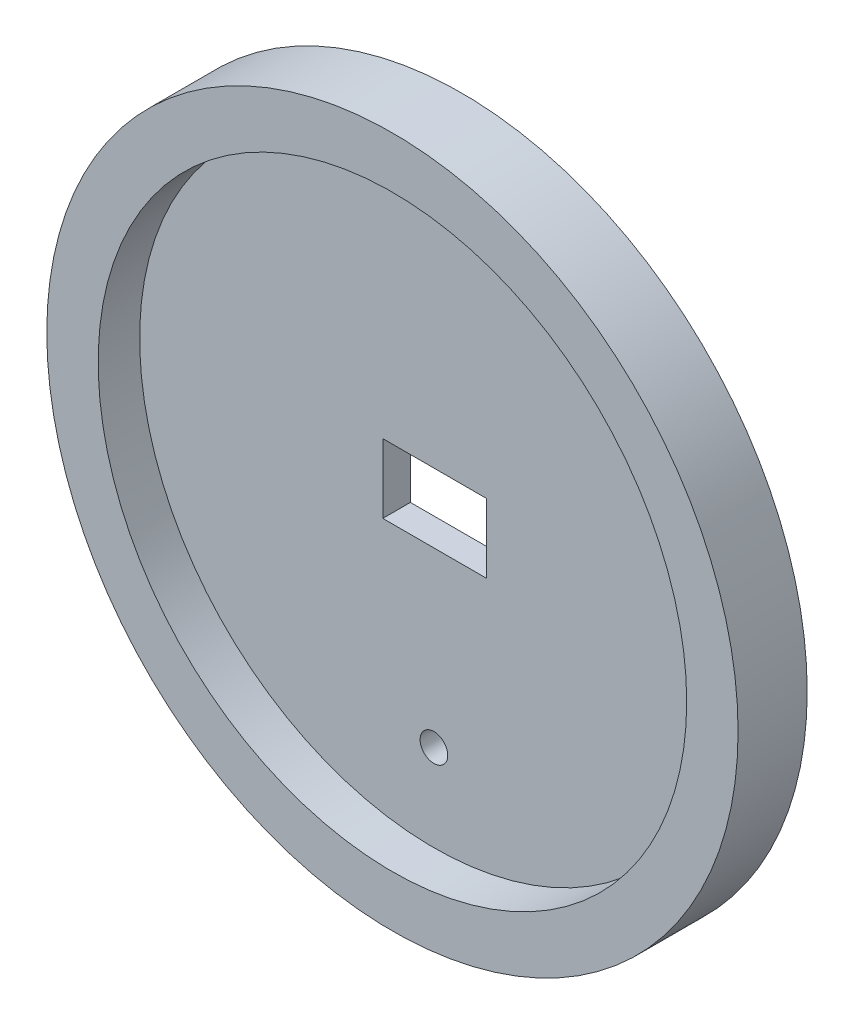
ISO-10303-21;
HEADER;
FILE_DESCRIPTION(('STEP AP214'),'2;1');
FILE_NAME('part.step','',(''),(''),'','','');
FILE_SCHEMA(('AUTOMOTIVE_DESIGN { 1 0 10303 214 1 1 1 1 }'));
ENDSEC;
DATA;
#1=APPLICATION_CONTEXT('core data for automotive mechanical design processes');
#2=APPLICATION_PROTOCOL_DEFINITION('international standard','automotive_design',2000,#1);
#3=PRODUCT_CONTEXT('',#1,'mechanical');
#4=PRODUCT('Part','Part','',(#3));
#5=PRODUCT_RELATED_PRODUCT_CATEGORY('part','',(#4));
#6=PRODUCT_DEFINITION_FORMATION('','',#4);
#7=PRODUCT_DEFINITION_CONTEXT('part definition',#1,'design');
#8=PRODUCT_DEFINITION('design','',#6,#7);
#9=PRODUCT_DEFINITION_SHAPE('','',#8);
#10=(LENGTH_UNIT() NAMED_UNIT(*) SI_UNIT(.MILLI.,.METRE.));
#11=(NAMED_UNIT(*) PLANE_ANGLE_UNIT() SI_UNIT($,.RADIAN.));
#12=(NAMED_UNIT(*) SI_UNIT($,.STERADIAN.) SOLID_ANGLE_UNIT());
#13=UNCERTAINTY_MEASURE_WITH_UNIT(LENGTH_MEASURE(1.E-05),#10,'distance_accuracy_value','');
#14=(GEOMETRIC_REPRESENTATION_CONTEXT(3) GLOBAL_UNCERTAINTY_ASSIGNED_CONTEXT((#13)) GLOBAL_UNIT_ASSIGNED_CONTEXT((#10,
#11,#12)) REPRESENTATION_CONTEXT('',''));
#15=CARTESIAN_POINT('',(0.,0.,0.));
#16=DIRECTION('',(0.,0.,1.));
#17=DIRECTION('',(1.,0.,0.));
#18=AXIS2_PLACEMENT_3D('',#15,#16,#17);
#19=CARTESIAN_POINT('',(-3.7,2.5,5.));
#20=DIRECTION('',(1.,0.,0.));
#21=DIRECTION('',(0.,0.,-1.));
#22=AXIS2_PLACEMENT_3D('',#19,#20,#21);
#23=PLANE('',#22);
#24=DIRECTION('',(0.,0.,-1.));
#25=VECTOR('',#24,1.);
#26=CARTESIAN_POINT('',(-3.7,2.5,5.));
#27=LINE('',#26,#25);
#28=CARTESIAN_POINT('',(-3.7,2.5,2.));
#29=VERTEX_POINT('',#28);
#30=CARTESIAN_POINT('',(-3.7,2.5,0.));
#31=VERTEX_POINT('',#30);
#32=EDGE_CURVE('E57',#29,#31,#27,.T.);
#33=ORIENTED_EDGE('',*,*,#32,.F.);
#34=DIRECTION('',(0.,-1.,0.));
#35=VECTOR('',#34,1.);
#36=CARTESIAN_POINT('',(-3.7,2.5,2.));
#37=LINE('',#36,#35);
#38=CARTESIAN_POINT('',(-3.7,-2.5,2.));
#39=VERTEX_POINT('',#38);
#40=EDGE_CURVE('E50',#29,#39,#37,.T.);
#41=ORIENTED_EDGE('',*,*,#40,.T.);
#42=DIRECTION('',(0.,0.,-1.));
#43=VECTOR('',#42,1.);
#44=CARTESIAN_POINT('',(-3.7,-2.5,5.));
#45=LINE('',#44,#43);
#46=CARTESIAN_POINT('',(-3.7,-2.5,0.));
#47=VERTEX_POINT('',#46);
#48=EDGE_CURVE('E95',#39,#47,#45,.T.);
#49=ORIENTED_EDGE('',*,*,#48,.T.);
#50=DIRECTION('',(0.,-1.,0.));
#51=VECTOR('',#50,1.);
#52=CARTESIAN_POINT('',(-3.7,2.5,0.));
#53=LINE('',#52,#51);
#54=EDGE_CURVE('E113',#31,#47,#53,.T.);
#55=ORIENTED_EDGE('',*,*,#54,.F.);
#56=EDGE_LOOP('',(#33,#41,#49,#55));
#57=FACE_BOUND('',#56,.T.);
#58=ADVANCED_FACE('F33',(#57),#23,.T.);
#59=CARTESIAN_POINT('',(-3.7,-2.5,5.));
#60=DIRECTION('',(0.,1.,0.));
#61=DIRECTION('',(0.,0.,1.));
#62=AXIS2_PLACEMENT_3D('',#59,#60,#61);
#63=PLANE('',#62);
#64=ORIENTED_EDGE('',*,*,#48,.F.);
#65=DIRECTION('',(1.,0.,0.));
#66=VECTOR('',#65,1.);
#67=CARTESIAN_POINT('',(-3.7,-2.5,2.));
#68=LINE('',#67,#66);
#69=CARTESIAN_POINT('',(3.8,-2.5,2.));
#70=VERTEX_POINT('',#69);
#71=EDGE_CURVE('E88',#39,#70,#68,.T.);
#72=ORIENTED_EDGE('',*,*,#71,.T.);
#73=DIRECTION('',(0.,0.,-1.));
#74=VECTOR('',#73,1.);
#75=CARTESIAN_POINT('',(3.8,-2.5,5.));
#76=LINE('',#75,#74);
#77=CARTESIAN_POINT('',(3.8,-2.5,0.));
#78=VERTEX_POINT('',#77);
#79=EDGE_CURVE('E87',#70,#78,#76,.T.);
#80=ORIENTED_EDGE('',*,*,#79,.T.);
#81=DIRECTION('',(1.,0.,0.));
#82=VECTOR('',#81,1.);
#83=CARTESIAN_POINT('',(-3.7,-2.5,0.));
#84=LINE('',#83,#82);
#85=EDGE_CURVE('E116',#47,#78,#84,.T.);
#86=ORIENTED_EDGE('',*,*,#85,.F.);
#87=EDGE_LOOP('',(#64,#72,#80,#86));
#88=FACE_BOUND('',#87,.T.);
#89=ADVANCED_FACE('F127',(#88),#63,.T.);
#90=CARTESIAN_POINT('',(3.8,2.5,5.));
#91=DIRECTION('',(-1.,0.,0.));
#92=DIRECTION('',(0.,-1.,0.));
#93=AXIS2_PLACEMENT_3D('',#90,#91,#92);
#94=PLANE('',#93);
#95=ORIENTED_EDGE('',*,*,#79,.F.);
#96=DIRECTION('',(0.,1.,0.));
#97=VECTOR('',#96,1.);
#98=CARTESIAN_POINT('',(3.8,2.5,2.));
#99=LINE('',#98,#97);
#100=CARTESIAN_POINT('',(3.8,2.5,2.));
#101=VERTEX_POINT('',#100);
#102=EDGE_CURVE('E78',#70,#101,#99,.T.);
#103=ORIENTED_EDGE('',*,*,#102,.T.);
#104=DIRECTION('',(0.,0.,-1.));
#105=VECTOR('',#104,1.);
#106=CARTESIAN_POINT('',(3.8,2.5,5.));
#107=LINE('',#106,#105);
#108=CARTESIAN_POINT('',(3.8,2.5,0.));
#109=VERTEX_POINT('',#108);
#110=EDGE_CURVE('E86',#101,#109,#107,.T.);
#111=ORIENTED_EDGE('',*,*,#110,.T.);
#112=DIRECTION('',(0.,1.,0.));
#113=VECTOR('',#112,1.);
#114=CARTESIAN_POINT('',(3.8,2.5,0.));
#115=LINE('',#114,#113);
#116=EDGE_CURVE('E123',#78,#109,#115,.T.);
#117=ORIENTED_EDGE('',*,*,#116,.F.);
#118=EDGE_LOOP('',(#95,#103,#111,#117));
#119=FACE_BOUND('',#118,.T.);
#120=ADVANCED_FACE('F84',(#119),#94,.T.);
#121=CARTESIAN_POINT('',(-3.7,2.5,5.));
#122=DIRECTION('',(0.,-1.,0.));
#123=DIRECTION('',(0.,0.,-1.));
#124=AXIS2_PLACEMENT_3D('',#121,#122,#123);
#125=PLANE('',#124);
#126=ORIENTED_EDGE('',*,*,#110,.F.);
#127=DIRECTION('',(-1.,0.,0.));
#128=VECTOR('',#127,1.);
#129=CARTESIAN_POINT('',(-3.7,2.5,2.));
#130=LINE('',#129,#128);
#131=EDGE_CURVE('E74',#101,#29,#130,.T.);
#132=ORIENTED_EDGE('',*,*,#131,.T.);
#133=ORIENTED_EDGE('',*,*,#32,.T.);
#134=DIRECTION('',(-1.,0.,0.));
#135=VECTOR('',#134,1.);
#136=CARTESIAN_POINT('',(-3.7,2.5,0.));
#137=LINE('',#136,#135);
#138=EDGE_CURVE('E92',#109,#31,#137,.T.);
#139=ORIENTED_EDGE('',*,*,#138,.F.);
#140=EDGE_LOOP('',(#126,#132,#133,#139));
#141=FACE_BOUND('',#140,.T.);
#142=ADVANCED_FACE('F90',(#141),#125,.T.);
#143=CARTESIAN_POINT('',(0.,-15.,5.));
#144=DIRECTION('',(0.,0.,-1.));
#145=DIRECTION('',(-1.,0.,0.));
#146=AXIS2_PLACEMENT_3D('',#143,#144,#145);
#147=CYLINDRICAL_SURFACE('',#146,1.);
#148=CARTESIAN_POINT('',(0.,-15.,0.));
#149=DIRECTION('',(0.,0.,1.));
#150=DIRECTION('',(1.,0.,0.));
#151=AXIS2_PLACEMENT_3D('',#148,#149,#150);
#152=CIRCLE('',#151,1.);
#153=CARTESIAN_POINT('',(1.,-15.,0.));
#154=VERTEX_POINT('',#153);
#155=EDGE_CURVE('E111',#154,#154,#152,.T.);
#156=ORIENTED_EDGE('',*,*,#155,.F.);
#157=EDGE_LOOP('',(#156));
#158=FACE_BOUND('',#157,.T.);
#159=CARTESIAN_POINT('',(0.,-15.,2.));
#160=DIRECTION('',(0.,0.,1.));
#161=DIRECTION('',(1.,0.,0.));
#162=AXIS2_PLACEMENT_3D('',#159,#160,#161);
#163=CIRCLE('',#162,1.);
#164=CARTESIAN_POINT('',(1.,-15.,2.));
#165=VERTEX_POINT('',#164);
#166=EDGE_CURVE('E37',#165,#165,#163,.T.);
#167=ORIENTED_EDGE('',*,*,#166,.T.);
#168=EDGE_LOOP('',(#167));
#169=FACE_BOUND('',#168,.T.);
#170=ADVANCED_FACE('F139',(#158,#169),#147,.F.);
#171=CARTESIAN_POINT('',(0.,0.,5.));
#172=DIRECTION('',(0.,0.,1.));
#173=DIRECTION('',(1.,0.,0.));
#174=AXIS2_PLACEMENT_3D('',#171,#172,#173);
#175=PLANE('',#174);
#176=CARTESIAN_POINT('',(0.,0.,5.));
#177=DIRECTION('',(0.,0.,1.));
#178=DIRECTION('',(1.,0.,0.));
#179=AXIS2_PLACEMENT_3D('',#176,#177,#178);
#180=CIRCLE('',#179,21.2841121427997);
#181=CARTESIAN_POINT('',(21.2841121427997,0.,5.));
#182=VERTEX_POINT('',#181);
#183=EDGE_CURVE('E129',#182,#182,#180,.T.);
#184=ORIENTED_EDGE('',*,*,#183,.F.);
#185=EDGE_LOOP('',(#184));
#186=FACE_BOUND('',#185,.T.);
#187=CARTESIAN_POINT('',(0.,0.,5.));
#188=DIRECTION('',(0.,0.,1.));
#189=DIRECTION('',(1.,0.,0.));
#190=AXIS2_PLACEMENT_3D('',#187,#188,#189);
#191=CIRCLE('',#190,25.);
#192=CARTESIAN_POINT('',(25.,0.,5.));
#193=VERTEX_POINT('',#192);
#194=EDGE_CURVE('E11',#193,#193,#191,.T.);
#195=ORIENTED_EDGE('',*,*,#194,.T.);
#196=EDGE_LOOP('',(#195));
#197=FACE_BOUND('',#196,.T.);
#198=ADVANCED_FACE('F107',(#186,#197),#175,.T.);
#199=CARTESIAN_POINT('',(0.,0.,0.));
#200=DIRECTION('',(0.,0.,1.));
#201=DIRECTION('',(1.,0.,0.));
#202=AXIS2_PLACEMENT_3D('',#199,#200,#201);
#203=PLANE('',#202);
#204=ORIENTED_EDGE('',*,*,#54,.T.);
#205=ORIENTED_EDGE('',*,*,#85,.T.);
#206=ORIENTED_EDGE('',*,*,#116,.T.);
#207=ORIENTED_EDGE('',*,*,#138,.T.);
#208=EDGE_LOOP('',(#204,#205,#206,#207));
#209=FACE_BOUND('',#208,.T.);
#210=CARTESIAN_POINT('',(0.,0.,0.));
#211=DIRECTION('',(0.,0.,1.));
#212=DIRECTION('',(1.,0.,0.));
#213=AXIS2_PLACEMENT_3D('',#210,#211,#212);
#214=CIRCLE('',#213,25.);
#215=CARTESIAN_POINT('',(25.,0.,0.));
#216=VERTEX_POINT('',#215);
#217=EDGE_CURVE('E42',#216,#216,#214,.T.);
#218=ORIENTED_EDGE('',*,*,#217,.F.);
#219=EDGE_LOOP('',(#218));
#220=FACE_BOUND('',#219,.T.);
#221=ORIENTED_EDGE('',*,*,#155,.T.);
#222=EDGE_LOOP('',(#221));
#223=FACE_BOUND('',#222,.T.);
#224=ADVANCED_FACE('F104',(#209,#220,#223),#203,.F.);
#225=CARTESIAN_POINT('',(0.,0.,5.));
#226=DIRECTION('',(0.,0.,-1.));
#227=DIRECTION('',(-1.,0.,0.));
#228=AXIS2_PLACEMENT_3D('',#225,#226,#227);
#229=CYLINDRICAL_SURFACE('',#228,25.);
#230=ORIENTED_EDGE('',*,*,#194,.F.);
#231=EDGE_LOOP('',(#230));
#232=FACE_BOUND('',#231,.T.);
#233=ORIENTED_EDGE('',*,*,#217,.T.);
#234=EDGE_LOOP('',(#233));
#235=FACE_BOUND('',#234,.T.);
#236=ADVANCED_FACE('F35',(#232,#235),#229,.T.);
#237=CARTESIAN_POINT('',(0.,0.,2.));
#238=DIRECTION('',(0.,0.,1.));
#239=DIRECTION('',(1.,0.,0.));
#240=AXIS2_PLACEMENT_3D('',#237,#238,#239);
#241=CYLINDRICAL_SURFACE('',#240,21.2841121427997);
#242=CARTESIAN_POINT('',(0.,0.,2.));
#243=DIRECTION('',(0.,0.,1.));
#244=DIRECTION('',(1.,0.,0.));
#245=AXIS2_PLACEMENT_3D('',#242,#243,#244);
#246=CIRCLE('',#245,21.2841121427997);
#247=CARTESIAN_POINT('',(21.2841121427997,0.,2.));
#248=VERTEX_POINT('',#247);
#249=EDGE_CURVE('E132',#248,#248,#246,.T.);
#250=ORIENTED_EDGE('',*,*,#249,.F.);
#251=EDGE_LOOP('',(#250));
#252=FACE_BOUND('',#251,.T.);
#253=ORIENTED_EDGE('',*,*,#183,.T.);
#254=EDGE_LOOP('',(#253));
#255=FACE_BOUND('',#254,.T.);
#256=ADVANCED_FACE('F141',(#252,#255),#241,.F.);
#257=CARTESIAN_POINT('',(0.,0.,2.));
#258=DIRECTION('',(0.,0.,1.));
#259=DIRECTION('',(1.,0.,0.));
#260=AXIS2_PLACEMENT_3D('',#257,#258,#259);
#261=PLANE('',#260);
#262=ORIENTED_EDGE('',*,*,#131,.F.);
#263=ORIENTED_EDGE('',*,*,#102,.F.);
#264=ORIENTED_EDGE('',*,*,#71,.F.);
#265=ORIENTED_EDGE('',*,*,#40,.F.);
#266=EDGE_LOOP('',(#262,#263,#264,#265));
#267=FACE_BOUND('',#266,.T.);
#268=ORIENTED_EDGE('',*,*,#166,.F.);
#269=EDGE_LOOP('',(#268));
#270=FACE_BOUND('',#269,.T.);
#271=ORIENTED_EDGE('',*,*,#249,.T.);
#272=EDGE_LOOP('',(#271));
#273=FACE_BOUND('',#272,.T.);
#274=ADVANCED_FACE('F76',(#267,#270,#273),#261,.T.);
#275=CLOSED_SHELL('',(#58,#89,#120,#142,#170,#198,#224,#236,#256,#274));
#276=MANIFOLD_SOLID_BREP('B2',#275);
#277=ADVANCED_BREP_SHAPE_REPRESENTATION('',(#18,#276),#14);
#278=SHAPE_DEFINITION_REPRESENTATION(#9,#277);
ENDSEC;
END-ISO-10303-21;
